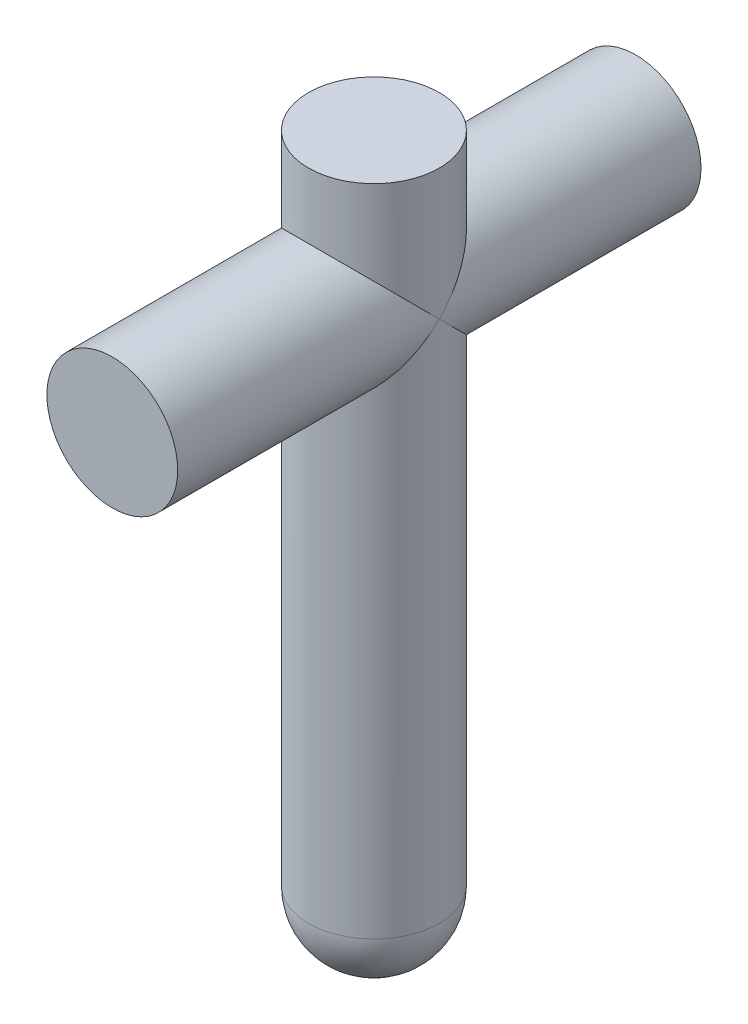
ISO-10303-21;
HEADER;
FILE_DESCRIPTION(('STEP AP214'),'2;1');
FILE_NAME('part.step','',(''),(''),'','','');
FILE_SCHEMA(('AUTOMOTIVE_DESIGN { 1 0 10303 214 1 1 1 1 }'));
ENDSEC;
DATA;
#1=APPLICATION_CONTEXT('core data for automotive mechanical design processes');
#2=APPLICATION_PROTOCOL_DEFINITION('international standard','automotive_design',2000,#1);
#3=PRODUCT_CONTEXT('',#1,'mechanical');
#4=PRODUCT('Part','Part','',(#3));
#5=PRODUCT_RELATED_PRODUCT_CATEGORY('part','',(#4));
#6=PRODUCT_DEFINITION_FORMATION('','',#4);
#7=PRODUCT_DEFINITION_CONTEXT('part definition',#1,'design');
#8=PRODUCT_DEFINITION('design','',#6,#7);
#9=PRODUCT_DEFINITION_SHAPE('','',#8);
#10=(LENGTH_UNIT() NAMED_UNIT(*) SI_UNIT(.MILLI.,.METRE.));
#11=(NAMED_UNIT(*) PLANE_ANGLE_UNIT() SI_UNIT($,.RADIAN.));
#12=(NAMED_UNIT(*) SI_UNIT($,.STERADIAN.) SOLID_ANGLE_UNIT());
#13=UNCERTAINTY_MEASURE_WITH_UNIT(LENGTH_MEASURE(1.E-05),#10,'distance_accuracy_value','');
#14=(GEOMETRIC_REPRESENTATION_CONTEXT(3) GLOBAL_UNCERTAINTY_ASSIGNED_CONTEXT((#13)) GLOBAL_UNIT_ASSIGNED_CONTEXT((#10,
#11,#12)) REPRESENTATION_CONTEXT('',''));
#15=CARTESIAN_POINT('',(0.,0.,0.));
#16=DIRECTION('',(0.,0.,1.));
#17=DIRECTION('',(1.,0.,0.));
#18=AXIS2_PLACEMENT_3D('',#15,#16,#17);
#19=CARTESIAN_POINT('',(0.,31.75,0.));
#20=DIRECTION('',(0.,-1.,0.));
#21=DIRECTION('',(0.,0.,-1.));
#22=AXIS2_PLACEMENT_3D('',#19,#20,#21);
#23=CYLINDRICAL_SURFACE('',#22,3.175);
#24=CARTESIAN_POINT('',(0.,31.75,0.));
#25=DIRECTION('',(0.,1.,0.));
#26=DIRECTION('',(0.,0.,1.));
#27=AXIS2_PLACEMENT_3D('',#24,#25,#26);
#28=CIRCLE('',#27,3.175);
#29=CARTESIAN_POINT('',(0.,31.75,3.175));
#30=VERTEX_POINT('',#29);
#31=EDGE_CURVE('E59',#30,#30,#28,.T.);
#32=ORIENTED_EDGE('',*,*,#31,.F.);
#33=EDGE_LOOP('',(#32));
#34=FACE_BOUND('',#33,.T.);
#35=CARTESIAN_POINT('',(0.,25.4,0.));
#36=DIRECTION('',(0.,-0.707106781186547,-0.707106781186547));
#37=DIRECTION('',(0.,-0.707106781186547,0.707106781186547));
#38=AXIS2_PLACEMENT_3D('',#35,#36,#37);
#39=ELLIPSE('',#38,4.49012806053458,3.175);
#40=CARTESIAN_POINT('',(-3.175,25.4,0.));
#41=VERTEX_POINT('',#40);
#42=CARTESIAN_POINT('',(3.175,25.4,0.));
#43=VERTEX_POINT('',#42);
#44=EDGE_CURVE('E42',#41,#43,#39,.T.);
#45=ORIENTED_EDGE('',*,*,#44,.F.);
#46=CARTESIAN_POINT('',(0.,25.4,0.));
#47=DIRECTION('',(0.,-0.707106781186547,0.707106781186547));
#48=DIRECTION('',(0.,-0.707106781186547,-0.707106781186547));
#49=AXIS2_PLACEMENT_3D('',#46,#47,#48);
#50=ELLIPSE('',#49,4.49012806053458,3.175);
#51=EDGE_CURVE('E54',#43,#41,#50,.T.);
#52=ORIENTED_EDGE('',*,*,#51,.F.);
#53=EDGE_LOOP('',(#45,#52));
#54=FACE_BOUND('',#53,.T.);
#55=ADVANCED_FACE('F33',(#34,#54),#23,.T.);
#56=CARTESIAN_POINT('',(0.,31.75,0.));
#57=DIRECTION('',(0.,1.,0.));
#58=DIRECTION('',(0.,0.,1.));
#59=AXIS2_PLACEMENT_3D('',#56,#57,#58);
#60=PLANE('',#59);
#61=ORIENTED_EDGE('',*,*,#31,.T.);
#62=EDGE_LOOP('',(#61));
#63=FACE_BOUND('',#62,.T.);
#64=ADVANCED_FACE('F82',(#63),#60,.T.);
#65=CARTESIAN_POINT('',(0.,25.4,-12.7));
#66=DIRECTION('',(0.,0.,1.));
#67=DIRECTION('',(1.,0.,0.));
#68=AXIS2_PLACEMENT_3D('',#65,#66,#67);
#69=PLANE('',#68);
#70=CARTESIAN_POINT('',(0.,25.4,-12.7));
#71=DIRECTION('',(0.,0.,1.));
#72=DIRECTION('',(1.,0.,0.));
#73=AXIS2_PLACEMENT_3D('',#70,#71,#72);
#74=CIRCLE('',#73,3.175);
#75=CARTESIAN_POINT('',(3.175,25.4,-12.7));
#76=VERTEX_POINT('',#75);
#77=EDGE_CURVE('E94',#76,#76,#74,.T.);
#78=ORIENTED_EDGE('',*,*,#77,.F.);
#79=EDGE_LOOP('',(#78));
#80=FACE_BOUND('',#79,.T.);
#81=ADVANCED_FACE('F79',(#80),#69,.F.);
#82=CARTESIAN_POINT('',(0.,25.4,12.7));
#83=DIRECTION('',(0.,0.,-1.));
#84=DIRECTION('',(-1.,0.,0.));
#85=AXIS2_PLACEMENT_3D('',#82,#83,#84);
#86=CYLINDRICAL_SURFACE('',#85,3.175);
#87=ORIENTED_EDGE('',*,*,#77,.T.);
#88=EDGE_LOOP('',(#87));
#89=FACE_BOUND('',#88,.T.);
#90=CARTESIAN_POINT('',(0.,25.4,0.));
#91=DIRECTION('',(0.,-0.707106781186547,0.707106781186547));
#92=DIRECTION('',(0.,-0.707106781186547,-0.707106781186547));
#93=AXIS2_PLACEMENT_3D('',#90,#91,#92);
#94=ELLIPSE('',#93,4.49012806053458,3.175);
#95=EDGE_CURVE('E48',#43,#41,#94,.F.);
#96=ORIENTED_EDGE('',*,*,#95,.T.);
#97=ORIENTED_EDGE('',*,*,#44,.T.);
#98=EDGE_LOOP('',(#96,#97));
#99=FACE_BOUND('',#98,.T.);
#100=ADVANCED_FACE('F61',(#89,#99),#86,.T.);
#101=CARTESIAN_POINT('',(0.,0.,0.));
#102=DIRECTION('',(0.,0.,1.));
#103=DIRECTION('',(1.,0.,0.));
#104=AXIS2_PLACEMENT_3D('',#101,#102,#103);
#105=SPHERICAL_SURFACE('',#104,3.175);
#106=CARTESIAN_POINT('',(0.,0.,0.));
#107=DIRECTION('',(0.,1.,0.));
#108=DIRECTION('',(0.,0.,1.));
#109=AXIS2_PLACEMENT_3D('',#106,#107,#108);
#110=SPHERICAL_SURFACE('',#109,3.175);
#111=CARTESIAN_POINT('',(0.,0.,0.));
#112=DIRECTION('',(0.,1.,0.));
#113=DIRECTION('',(0.,0.,1.));
#114=AXIS2_PLACEMENT_3D('',#111,#112,#113);
#115=CIRCLE('',#114,3.175);
#116=CARTESIAN_POINT('',(0.,0.,3.175));
#117=VERTEX_POINT('',#116);
#118=EDGE_CURVE('E37',#117,#117,#115,.T.);
#119=ORIENTED_EDGE('',*,*,#118,.F.);
#120=EDGE_LOOP('',(#119));
#121=FACE_BOUND('',#120,.T.);
#122=ADVANCED_FACE('F35',(#121),#110,.T.);
#123=ORIENTED_EDGE('',*,*,#118,.T.);
#124=EDGE_LOOP('',(#123));
#125=FACE_BOUND('',#124,.T.);
#126=CARTESIAN_POINT('',(0.,25.4,0.));
#127=DIRECTION('',(0.,-0.707106781186547,-0.707106781186547));
#128=DIRECTION('',(0.,-0.707106781186547,0.707106781186547));
#129=AXIS2_PLACEMENT_3D('',#126,#127,#128);
#130=ELLIPSE('',#129,4.49012806053458,3.175);
#131=EDGE_CURVE('E11',#41,#43,#130,.F.);
#132=ORIENTED_EDGE('',*,*,#131,.F.);
#133=ORIENTED_EDGE('',*,*,#95,.F.);
#134=EDGE_LOOP('',(#132,#133));
#135=FACE_BOUND('',#134,.T.);
#136=ADVANCED_FACE('F58',(#125,#135),#23,.T.);
#137=CARTESIAN_POINT('',(0.,25.4,12.7));
#138=DIRECTION('',(0.,0.,1.));
#139=DIRECTION('',(1.,0.,0.));
#140=AXIS2_PLACEMENT_3D('',#137,#138,#139);
#141=CIRCLE('',#140,3.175);
#142=CARTESIAN_POINT('',(3.175,25.4,12.7));
#143=VERTEX_POINT('',#142);
#144=EDGE_CURVE('E92',#143,#143,#141,.T.);
#145=ORIENTED_EDGE('',*,*,#144,.F.);
#146=EDGE_LOOP('',(#145));
#147=FACE_BOUND('',#146,.T.);
#148=ORIENTED_EDGE('',*,*,#51,.T.);
#149=ORIENTED_EDGE('',*,*,#131,.T.);
#150=EDGE_LOOP('',(#148,#149));
#151=FACE_BOUND('',#150,.T.);
#152=ADVANCED_FACE('F63',(#147,#151),#86,.T.);
#153=CARTESIAN_POINT('',(0.,25.4,12.7));
#154=DIRECTION('',(0.,0.,1.));
#155=DIRECTION('',(1.,0.,0.));
#156=AXIS2_PLACEMENT_3D('',#153,#154,#155);
#157=PLANE('',#156);
#158=ORIENTED_EDGE('',*,*,#144,.T.);
#159=EDGE_LOOP('',(#158));
#160=FACE_BOUND('',#159,.T.);
#161=ADVANCED_FACE('F65',(#160),#157,.T.);
#162=CLOSED_SHELL('',(#55,#64,#81,#100,#122,#136,#152,#161));
#163=MANIFOLD_SOLID_BREP('B2',#162);
#164=ADVANCED_BREP_SHAPE_REPRESENTATION('',(#18,#163),#14);
#165=SHAPE_DEFINITION_REPRESENTATION(#9,#164);
ENDSEC;
END-ISO-10303-21;
